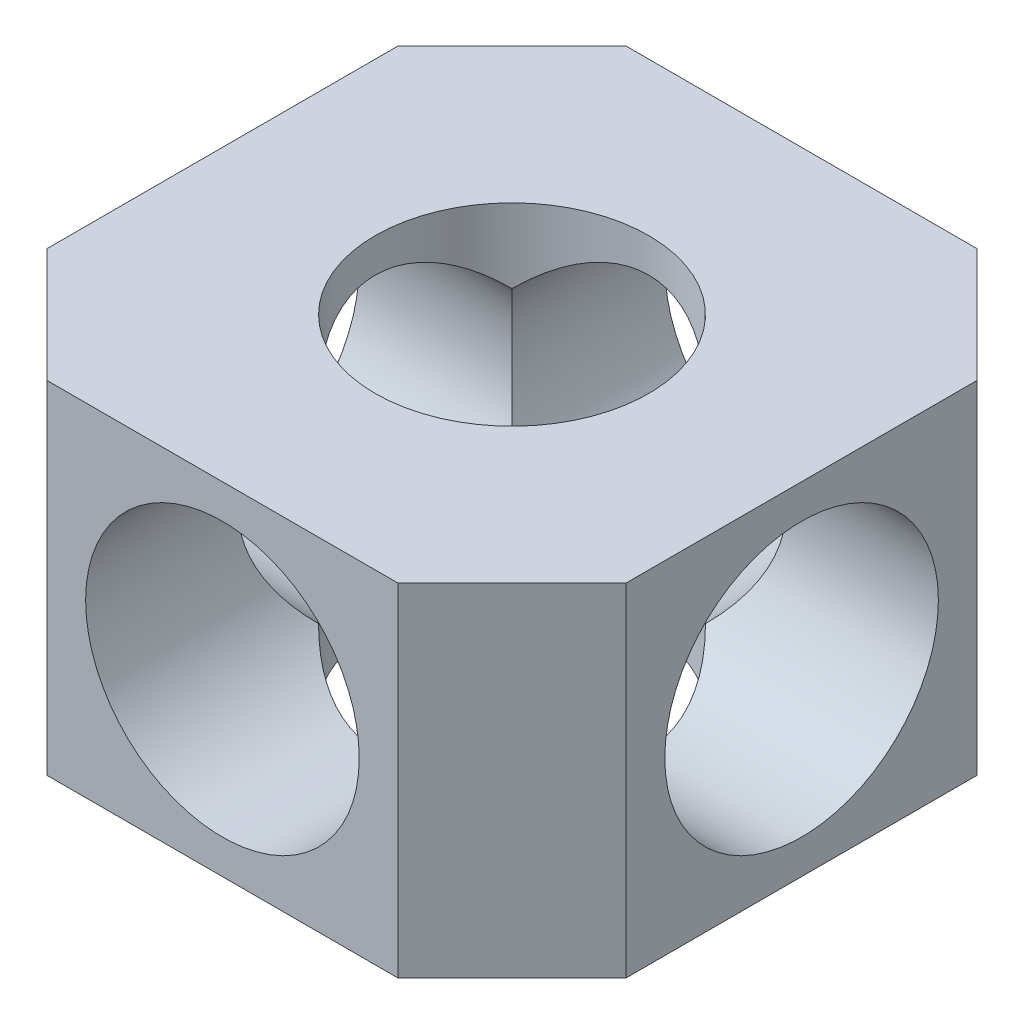
ISO-10303-21;
HEADER;
FILE_DESCRIPTION(('STEP AP214'),'2;1');
FILE_NAME('part.step','',(''),(''),'','','');
FILE_SCHEMA(('AUTOMOTIVE_DESIGN { 1 0 10303 214 1 1 1 1 }'));
ENDSEC;
DATA;
#1=APPLICATION_CONTEXT('core data for automotive mechanical design processes');
#2=APPLICATION_PROTOCOL_DEFINITION('international standard','automotive_design',2000,#1);
#3=PRODUCT_CONTEXT('',#1,'mechanical');
#4=PRODUCT('Part','Part','',(#3));
#5=PRODUCT_RELATED_PRODUCT_CATEGORY('part','',(#4));
#6=PRODUCT_DEFINITION_FORMATION('','',#4);
#7=PRODUCT_DEFINITION_CONTEXT('part definition',#1,'design');
#8=PRODUCT_DEFINITION('design','',#6,#7);
#9=PRODUCT_DEFINITION_SHAPE('','',#8);
#10=(LENGTH_UNIT() NAMED_UNIT(*) SI_UNIT(.MILLI.,.METRE.));
#11=(NAMED_UNIT(*) PLANE_ANGLE_UNIT() SI_UNIT($,.RADIAN.));
#12=(NAMED_UNIT(*) SI_UNIT($,.STERADIAN.) SOLID_ANGLE_UNIT());
#13=UNCERTAINTY_MEASURE_WITH_UNIT(LENGTH_MEASURE(1.E-05),#10,'distance_accuracy_value','');
#14=(GEOMETRIC_REPRESENTATION_CONTEXT(3) GLOBAL_UNCERTAINTY_ASSIGNED_CONTEXT((#13)) GLOBAL_UNIT_ASSIGNED_CONTEXT((#10,
#11,#12)) REPRESENTATION_CONTEXT('',''));
#15=CARTESIAN_POINT('',(0.,0.,0.));
#16=DIRECTION('',(0.,0.,1.));
#17=DIRECTION('',(1.,0.,0.));
#18=AXIS2_PLACEMENT_3D('',#15,#16,#17);
#19=CARTESIAN_POINT('',(0.,7.5,0.));
#20=DIRECTION('',(0.,-1.,0.));
#21=DIRECTION('',(0.,0.,-1.));
#22=AXIS2_PLACEMENT_3D('',#19,#20,#21);
#23=CYLINDRICAL_SURFACE('',#22,6.);
#24=CARTESIAN_POINT('',(0.,0.,0.));
#25=DIRECTION('',(0.707106781186547,-0.707106781186548,0.));
#26=DIRECTION('',(-0.707106781186547,-0.707106781186548,0.));
#27=AXIS2_PLACEMENT_3D('',#24,#25,#26);
#28=ELLIPSE('',#27,8.48528137423857,6.);
#29=CARTESIAN_POINT('',(4.24264068711928,4.24264068711928,4.24264068711929));
#30=VERTEX_POINT('',#29);
#31=CARTESIAN_POINT('',(4.24264068711928,4.24264068711929,-4.24264068711928));
#32=VERTEX_POINT('',#31);
#33=EDGE_CURVE('E131',#30,#32,#28,.F.);
#34=ORIENTED_EDGE('',*,*,#33,.F.);
#35=CARTESIAN_POINT('',(0.,0.,0.));
#36=DIRECTION('',(0.,-0.707106781186547,0.707106781186547));
#37=DIRECTION('',(0.,-0.707106781186547,-0.707106781186547));
#38=AXIS2_PLACEMENT_3D('',#35,#36,#37);
#39=ELLIPSE('',#38,8.48528137423857,6.);
#40=CARTESIAN_POINT('',(-4.24264068711929,4.24264068711929,4.24264068711929));
#41=VERTEX_POINT('',#40);
#42=EDGE_CURVE('E138',#41,#30,#39,.F.);
#43=ORIENTED_EDGE('',*,*,#42,.F.);
#44=CARTESIAN_POINT('',(0.,0.,0.));
#45=DIRECTION('',(-0.707106781186547,-0.707106781186548,0.));
#46=DIRECTION('',(0.707106781186547,-0.707106781186548,0.));
#47=AXIS2_PLACEMENT_3D('',#44,#45,#46);
#48=ELLIPSE('',#47,8.48528137423857,6.);
#49=CARTESIAN_POINT('',(-4.24264068711929,4.24264068711928,-4.24264068711928));
#50=VERTEX_POINT('',#49);
#51=EDGE_CURVE('E67',#50,#41,#48,.F.);
#52=ORIENTED_EDGE('',*,*,#51,.F.);
#53=CARTESIAN_POINT('',(0.,0.,0.));
#54=DIRECTION('',(0.,-0.707106781186547,-0.707106781186547));
#55=DIRECTION('',(0.,-0.707106781186547,0.707106781186547));
#56=AXIS2_PLACEMENT_3D('',#53,#54,#55);
#57=ELLIPSE('',#56,8.48528137423857,6.);
#58=EDGE_CURVE('E144',#32,#50,#57,.F.);
#59=ORIENTED_EDGE('',*,*,#58,.F.);
#60=EDGE_LOOP('',(#34,#43,#52,#59));
#61=FACE_BOUND('',#60,.T.);
#62=CARTESIAN_POINT('',(0.,7.5,0.));
#63=DIRECTION('',(0.,1.,0.));
#64=DIRECTION('',(0.,0.,1.));
#65=AXIS2_PLACEMENT_3D('',#62,#63,#64);
#66=CIRCLE('',#65,6.);
#67=CARTESIAN_POINT('',(0.,7.5,6.));
#68=VERTEX_POINT('',#67);
#69=EDGE_CURVE('E221',#68,#68,#66,.T.);
#70=ORIENTED_EDGE('',*,*,#69,.T.);
#71=EDGE_LOOP('',(#70));
#72=FACE_BOUND('',#71,.T.);
#73=ADVANCED_FACE('F43',(#61,#72),#23,.F.);
#74=CARTESIAN_POINT('',(0.,7.5,0.));
#75=DIRECTION('',(0.,1.,0.));
#76=DIRECTION('',(0.,0.,1.));
#77=AXIS2_PLACEMENT_3D('',#74,#75,#76);
#78=PLANE('',#77);
#79=DIRECTION('',(0.,0.,1.));
#80=VECTOR('',#79,1.);
#81=CARTESIAN_POINT('',(-12.7,7.5,-7.7));
#82=LINE('',#81,#80);
#83=CARTESIAN_POINT('',(-12.7,7.5,-7.7));
#84=VERTEX_POINT('',#83);
#85=CARTESIAN_POINT('',(-12.7,7.5,7.7));
#86=VERTEX_POINT('',#85);
#87=EDGE_CURVE('E198',#84,#86,#82,.T.);
#88=ORIENTED_EDGE('',*,*,#87,.T.);
#89=DIRECTION('',(0.707106781186548,0.,0.707106781186547));
#90=VECTOR('',#89,1.);
#91=CARTESIAN_POINT('',(-12.7,7.5,7.7));
#92=LINE('',#91,#90);
#93=CARTESIAN_POINT('',(-7.69999999999999,7.5,12.7));
#94=VERTEX_POINT('',#93);
#95=EDGE_CURVE('E239',#86,#94,#92,.T.);
#96=ORIENTED_EDGE('',*,*,#95,.T.);
#97=DIRECTION('',(1.,0.,0.));
#98=VECTOR('',#97,1.);
#99=CARTESIAN_POINT('',(-7.69999999999999,7.5,12.7));
#100=LINE('',#99,#98);
#101=CARTESIAN_POINT('',(7.7,7.5,12.7));
#102=VERTEX_POINT('',#101);
#103=EDGE_CURVE('E236',#94,#102,#100,.T.);
#104=ORIENTED_EDGE('',*,*,#103,.T.);
#105=DIRECTION('',(0.707106781186548,0.,-0.707106781186548));
#106=VECTOR('',#105,1.);
#107=CARTESIAN_POINT('',(7.7,7.5,12.7));
#108=LINE('',#107,#106);
#109=CARTESIAN_POINT('',(12.7,7.5,7.7));
#110=VERTEX_POINT('',#109);
#111=EDGE_CURVE('E233',#102,#110,#108,.T.);
#112=ORIENTED_EDGE('',*,*,#111,.T.);
#113=DIRECTION('',(0.,0.,-1.));
#114=VECTOR('',#113,1.);
#115=CARTESIAN_POINT('',(12.7,7.5,-7.7));
#116=LINE('',#115,#114);
#117=CARTESIAN_POINT('',(12.7,7.5,-7.7));
#118=VERTEX_POINT('',#117);
#119=EDGE_CURVE('E230',#110,#118,#116,.T.);
#120=ORIENTED_EDGE('',*,*,#119,.T.);
#121=DIRECTION('',(-0.707106781186548,0.,-0.707106781186548));
#122=VECTOR('',#121,1.);
#123=CARTESIAN_POINT('',(7.7,7.5,-12.7));
#124=LINE('',#123,#122);
#125=CARTESIAN_POINT('',(7.7,7.5,-12.7));
#126=VERTEX_POINT('',#125);
#127=EDGE_CURVE('E227',#118,#126,#124,.T.);
#128=ORIENTED_EDGE('',*,*,#127,.T.);
#129=DIRECTION('',(-1.,0.,0.));
#130=VECTOR('',#129,1.);
#131=CARTESIAN_POINT('',(-7.7,7.5,-12.7));
#132=LINE('',#131,#130);
#133=CARTESIAN_POINT('',(-7.7,7.5,-12.7));
#134=VERTEX_POINT('',#133);
#135=EDGE_CURVE('E224',#126,#134,#132,.T.);
#136=ORIENTED_EDGE('',*,*,#135,.T.);
#137=DIRECTION('',(-0.707106781186548,0.,0.707106781186548));
#138=VECTOR('',#137,1.);
#139=CARTESIAN_POINT('',(-12.7,7.5,-7.7));
#140=LINE('',#139,#138);
#141=EDGE_CURVE('E194',#134,#84,#140,.T.);
#142=ORIENTED_EDGE('',*,*,#141,.T.);
#143=EDGE_LOOP('',(#88,#96,#104,#112,#120,#128,#136,#142));
#144=FACE_BOUND('',#143,.T.);
#145=ORIENTED_EDGE('',*,*,#69,.F.);
#146=EDGE_LOOP('',(#145));
#147=FACE_BOUND('',#146,.T.);
#148=ADVANCED_FACE('F293',(#144,#147),#78,.T.);
#149=CARTESIAN_POINT('',(0.,-7.5,0.));
#150=DIRECTION('',(0.,1.,0.));
#151=DIRECTION('',(0.,0.,1.));
#152=AXIS2_PLACEMENT_3D('',#149,#150,#151);
#153=PLANE('',#152);
#154=DIRECTION('',(0.,0.,1.));
#155=VECTOR('',#154,1.);
#156=CARTESIAN_POINT('',(-12.7,-7.5,-7.7));
#157=LINE('',#156,#155);
#158=CARTESIAN_POINT('',(-12.7,-7.5,-7.7));
#159=VERTEX_POINT('',#158);
#160=CARTESIAN_POINT('',(-12.7,-7.5,7.7));
#161=VERTEX_POINT('',#160);
#162=EDGE_CURVE('E217',#159,#161,#157,.T.);
#163=ORIENTED_EDGE('',*,*,#162,.F.);
#164=DIRECTION('',(-0.707106781186548,0.,0.707106781186548));
#165=VECTOR('',#164,1.);
#166=CARTESIAN_POINT('',(-12.7,-7.5,-7.7));
#167=LINE('',#166,#165);
#168=CARTESIAN_POINT('',(-7.7,-7.5,-12.7));
#169=VERTEX_POINT('',#168);
#170=EDGE_CURVE('E195',#169,#159,#167,.T.);
#171=ORIENTED_EDGE('',*,*,#170,.F.);
#172=DIRECTION('',(-1.,0.,0.));
#173=VECTOR('',#172,1.);
#174=CARTESIAN_POINT('',(-7.7,-7.5,-12.7));
#175=LINE('',#174,#173);
#176=CARTESIAN_POINT('',(7.7,-7.5,-12.7));
#177=VERTEX_POINT('',#176);
#178=EDGE_CURVE('E199',#177,#169,#175,.T.);
#179=ORIENTED_EDGE('',*,*,#178,.F.);
#180=DIRECTION('',(-0.707106781186548,0.,-0.707106781186548));
#181=VECTOR('',#180,1.);
#182=CARTESIAN_POINT('',(7.7,-7.5,-12.7));
#183=LINE('',#182,#181);
#184=CARTESIAN_POINT('',(12.7,-7.5,-7.7));
#185=VERTEX_POINT('',#184);
#186=EDGE_CURVE('E202',#185,#177,#183,.T.);
#187=ORIENTED_EDGE('',*,*,#186,.F.);
#188=DIRECTION('',(0.,0.,-1.));
#189=VECTOR('',#188,1.);
#190=CARTESIAN_POINT('',(12.7,-7.5,-7.7));
#191=LINE('',#190,#189);
#192=CARTESIAN_POINT('',(12.7,-7.5,7.7));
#193=VERTEX_POINT('',#192);
#194=EDGE_CURVE('E205',#193,#185,#191,.T.);
#195=ORIENTED_EDGE('',*,*,#194,.F.);
#196=DIRECTION('',(0.707106781186548,0.,-0.707106781186548));
#197=VECTOR('',#196,1.);
#198=CARTESIAN_POINT('',(7.7,-7.5,12.7));
#199=LINE('',#198,#197);
#200=CARTESIAN_POINT('',(7.7,-7.5,12.7));
#201=VERTEX_POINT('',#200);
#202=EDGE_CURVE('E208',#201,#193,#199,.T.);
#203=ORIENTED_EDGE('',*,*,#202,.F.);
#204=DIRECTION('',(1.,0.,0.));
#205=VECTOR('',#204,1.);
#206=CARTESIAN_POINT('',(-7.69999999999999,-7.5,12.7));
#207=LINE('',#206,#205);
#208=CARTESIAN_POINT('',(-7.69999999999999,-7.5,12.7));
#209=VERTEX_POINT('',#208);
#210=EDGE_CURVE('E211',#209,#201,#207,.T.);
#211=ORIENTED_EDGE('',*,*,#210,.F.);
#212=DIRECTION('',(0.707106781186548,0.,0.707106781186547));
#213=VECTOR('',#212,1.);
#214=CARTESIAN_POINT('',(-12.7,-7.5,7.7));
#215=LINE('',#214,#213);
#216=EDGE_CURVE('E214',#161,#209,#215,.T.);
#217=ORIENTED_EDGE('',*,*,#216,.F.);
#218=EDGE_LOOP('',(#163,#171,#179,#187,#195,#203,#211,#217));
#219=FACE_BOUND('',#218,.T.);
#220=CARTESIAN_POINT('',(0.,-7.5,0.));
#221=DIRECTION('',(0.,1.,0.));
#222=DIRECTION('',(0.,0.,1.));
#223=AXIS2_PLACEMENT_3D('',#220,#221,#222);
#224=CIRCLE('',#223,6.);
#225=CARTESIAN_POINT('',(0.,-7.5,6.));
#226=VERTEX_POINT('',#225);
#227=EDGE_CURVE('E245',#226,#226,#224,.T.);
#228=ORIENTED_EDGE('',*,*,#227,.T.);
#229=EDGE_LOOP('',(#228));
#230=FACE_BOUND('',#229,.T.);
#231=ADVANCED_FACE('F299',(#219,#230),#153,.F.);
#232=CARTESIAN_POINT('',(-12.7,7.5,-7.7));
#233=DIRECTION('',(1.,0.,0.));
#234=DIRECTION('',(0.,0.,-1.));
#235=AXIS2_PLACEMENT_3D('',#232,#233,#234);
#236=PLANE('',#235);
#237=CARTESIAN_POINT('',(-12.7,0.,0.));
#238=DIRECTION('',(1.,0.,0.));
#239=DIRECTION('',(0.,0.,-1.));
#240=AXIS2_PLACEMENT_3D('',#237,#238,#239);
#241=CIRCLE('',#240,6.);
#242=CARTESIAN_POINT('',(-12.7,0.,-6.));
#243=VERTEX_POINT('',#242);
#244=EDGE_CURVE('E273',#243,#243,#241,.T.);
#245=ORIENTED_EDGE('',*,*,#244,.T.);
#246=EDGE_LOOP('',(#245));
#247=FACE_BOUND('',#246,.T.);
#248=ORIENTED_EDGE('',*,*,#162,.T.);
#249=DIRECTION('',(0.,-1.,0.));
#250=VECTOR('',#249,1.);
#251=CARTESIAN_POINT('',(-12.7,7.5,7.7));
#252=LINE('',#251,#250);
#253=EDGE_CURVE('E162',#86,#161,#252,.T.);
#254=ORIENTED_EDGE('',*,*,#253,.F.);
#255=ORIENTED_EDGE('',*,*,#87,.F.);
#256=DIRECTION('',(0.,-1.,0.));
#257=VECTOR('',#256,1.);
#258=CARTESIAN_POINT('',(-12.7,7.5,-7.7));
#259=LINE('',#258,#257);
#260=EDGE_CURVE('E190',#84,#159,#259,.T.);
#261=ORIENTED_EDGE('',*,*,#260,.T.);
#262=EDGE_LOOP('',(#248,#254,#255,#261));
#263=FACE_BOUND('',#262,.T.);
#264=ADVANCED_FACE('F45',(#247,#263),#236,.F.);
#265=CARTESIAN_POINT('',(-12.7,7.5,7.7));
#266=DIRECTION('',(0.707106781186547,0.,-0.707106781186548));
#267=DIRECTION('',(-0.707106781186548,0.,-0.707106781186547));
#268=AXIS2_PLACEMENT_3D('',#265,#266,#267);
#269=PLANE('',#268);
#270=ORIENTED_EDGE('',*,*,#216,.T.);
#271=DIRECTION('',(0.,-1.,0.));
#272=VECTOR('',#271,1.);
#273=CARTESIAN_POINT('',(-7.69999999999999,7.5,12.7));
#274=LINE('',#273,#272);
#275=EDGE_CURVE('E166',#94,#209,#274,.T.);
#276=ORIENTED_EDGE('',*,*,#275,.F.);
#277=ORIENTED_EDGE('',*,*,#95,.F.);
#278=ORIENTED_EDGE('',*,*,#253,.T.);
#279=EDGE_LOOP('',(#270,#276,#277,#278));
#280=FACE_BOUND('',#279,.T.);
#281=ADVANCED_FACE('F325',(#280),#269,.F.);
#282=CARTESIAN_POINT('',(-7.69999999999999,7.5,12.7));
#283=DIRECTION('',(0.,0.,-1.));
#284=DIRECTION('',(-1.,0.,0.));
#285=AXIS2_PLACEMENT_3D('',#282,#283,#284);
#286=PLANE('',#285);
#287=CARTESIAN_POINT('',(0.,0.,12.7));
#288=DIRECTION('',(0.,0.,1.));
#289=DIRECTION('',(1.,0.,0.));
#290=AXIS2_PLACEMENT_3D('',#287,#288,#289);
#291=CIRCLE('',#290,6.);
#292=CARTESIAN_POINT('',(6.,0.,12.7));
#293=VERTEX_POINT('',#292);
#294=EDGE_CURVE('E253',#293,#293,#291,.T.);
#295=ORIENTED_EDGE('',*,*,#294,.F.);
#296=EDGE_LOOP('',(#295));
#297=FACE_BOUND('',#296,.T.);
#298=ORIENTED_EDGE('',*,*,#210,.T.);
#299=DIRECTION('',(0.,-1.,0.));
#300=VECTOR('',#299,1.);
#301=CARTESIAN_POINT('',(7.7,7.5,12.7));
#302=LINE('',#301,#300);
#303=EDGE_CURVE('E170',#102,#201,#302,.T.);
#304=ORIENTED_EDGE('',*,*,#303,.F.);
#305=ORIENTED_EDGE('',*,*,#103,.F.);
#306=ORIENTED_EDGE('',*,*,#275,.T.);
#307=EDGE_LOOP('',(#298,#304,#305,#306));
#308=FACE_BOUND('',#307,.T.);
#309=ADVANCED_FACE('F342',(#297,#308),#286,.F.);
#310=CARTESIAN_POINT('',(7.7,7.5,12.7));
#311=DIRECTION('',(-0.707106781186547,0.,-0.707106781186547));
#312=DIRECTION('',(-0.707106781186548,0.,0.707106781186548));
#313=AXIS2_PLACEMENT_3D('',#310,#311,#312);
#314=PLANE('',#313);
#315=ORIENTED_EDGE('',*,*,#202,.T.);
#316=DIRECTION('',(0.,-1.,0.));
#317=VECTOR('',#316,1.);
#318=CARTESIAN_POINT('',(12.7,7.5,7.7));
#319=LINE('',#318,#317);
#320=EDGE_CURVE('E174',#110,#193,#319,.T.);
#321=ORIENTED_EDGE('',*,*,#320,.F.);
#322=ORIENTED_EDGE('',*,*,#111,.F.);
#323=ORIENTED_EDGE('',*,*,#303,.T.);
#324=EDGE_LOOP('',(#315,#321,#322,#323));
#325=FACE_BOUND('',#324,.T.);
#326=ADVANCED_FACE('F338',(#325),#314,.F.);
#327=CARTESIAN_POINT('',(12.7,7.5,-7.7));
#328=DIRECTION('',(-1.,0.,0.));
#329=DIRECTION('',(0.,0.,1.));
#330=AXIS2_PLACEMENT_3D('',#327,#328,#329);
#331=PLANE('',#330);
#332=CARTESIAN_POINT('',(12.7,0.,0.));
#333=DIRECTION('',(1.,0.,0.));
#334=DIRECTION('',(0.,0.,-1.));
#335=AXIS2_PLACEMENT_3D('',#332,#333,#334);
#336=CIRCLE('',#335,6.);
#337=CARTESIAN_POINT('',(12.7,0.,-6.));
#338=VERTEX_POINT('',#337);
#339=EDGE_CURVE('E274',#338,#338,#336,.T.);
#340=ORIENTED_EDGE('',*,*,#339,.F.);
#341=EDGE_LOOP('',(#340));
#342=FACE_BOUND('',#341,.T.);
#343=ORIENTED_EDGE('',*,*,#194,.T.);
#344=DIRECTION('',(0.,-1.,0.));
#345=VECTOR('',#344,1.);
#346=CARTESIAN_POINT('',(12.7,7.5,-7.7));
#347=LINE('',#346,#345);
#348=EDGE_CURVE('E178',#118,#185,#347,.T.);
#349=ORIENTED_EDGE('',*,*,#348,.F.);
#350=ORIENTED_EDGE('',*,*,#119,.F.);
#351=ORIENTED_EDGE('',*,*,#320,.T.);
#352=EDGE_LOOP('',(#343,#349,#350,#351));
#353=FACE_BOUND('',#352,.T.);
#354=ADVANCED_FACE('F334',(#342,#353),#331,.F.);
#355=CARTESIAN_POINT('',(7.7,7.5,-12.7));
#356=DIRECTION('',(-0.707106781186547,0.,0.707106781186547));
#357=DIRECTION('',(0.707106781186548,0.,0.707106781186548));
#358=AXIS2_PLACEMENT_3D('',#355,#356,#357);
#359=PLANE('',#358);
#360=ORIENTED_EDGE('',*,*,#186,.T.);
#361=DIRECTION('',(0.,-1.,0.));
#362=VECTOR('',#361,1.);
#363=CARTESIAN_POINT('',(7.7,7.5,-12.7));
#364=LINE('',#363,#362);
#365=EDGE_CURVE('E182',#126,#177,#364,.T.);
#366=ORIENTED_EDGE('',*,*,#365,.F.);
#367=ORIENTED_EDGE('',*,*,#127,.F.);
#368=ORIENTED_EDGE('',*,*,#348,.T.);
#369=EDGE_LOOP('',(#360,#366,#367,#368));
#370=FACE_BOUND('',#369,.T.);
#371=ADVANCED_FACE('F330',(#370),#359,.F.);
#372=CARTESIAN_POINT('',(-7.7,7.5,-12.7));
#373=DIRECTION('',(0.,0.,1.));
#374=DIRECTION('',(1.,0.,0.));
#375=AXIS2_PLACEMENT_3D('',#372,#373,#374);
#376=PLANE('',#375);
#377=CARTESIAN_POINT('',(0.,0.,-12.7));
#378=DIRECTION('',(0.,0.,1.));
#379=DIRECTION('',(1.,0.,0.));
#380=AXIS2_PLACEMENT_3D('',#377,#378,#379);
#381=CIRCLE('',#380,6.);
#382=CARTESIAN_POINT('',(6.,0.,-12.7));
#383=VERTEX_POINT('',#382);
#384=EDGE_CURVE('E249',#383,#383,#381,.T.);
#385=ORIENTED_EDGE('',*,*,#384,.T.);
#386=EDGE_LOOP('',(#385));
#387=FACE_BOUND('',#386,.T.);
#388=ORIENTED_EDGE('',*,*,#178,.T.);
#389=DIRECTION('',(0.,-1.,0.));
#390=VECTOR('',#389,1.);
#391=CARTESIAN_POINT('',(-7.7,7.5,-12.7));
#392=LINE('',#391,#390);
#393=EDGE_CURVE('E186',#134,#169,#392,.T.);
#394=ORIENTED_EDGE('',*,*,#393,.F.);
#395=ORIENTED_EDGE('',*,*,#135,.F.);
#396=ORIENTED_EDGE('',*,*,#365,.T.);
#397=EDGE_LOOP('',(#388,#394,#395,#396));
#398=FACE_BOUND('',#397,.T.);
#399=ADVANCED_FACE('F311',(#387,#398),#376,.F.);
#400=CARTESIAN_POINT('',(-12.7,7.5,-7.7));
#401=DIRECTION('',(0.707106781186547,0.,0.707106781186547));
#402=DIRECTION('',(0.707106781186548,0.,-0.707106781186548));
#403=AXIS2_PLACEMENT_3D('',#400,#401,#402);
#404=PLANE('',#403);
#405=ORIENTED_EDGE('',*,*,#170,.T.);
#406=ORIENTED_EDGE('',*,*,#260,.F.);
#407=ORIENTED_EDGE('',*,*,#141,.F.);
#408=ORIENTED_EDGE('',*,*,#393,.T.);
#409=EDGE_LOOP('',(#405,#406,#407,#408));
#410=FACE_BOUND('',#409,.T.);
#411=ADVANCED_FACE('F304',(#410),#404,.F.);
#412=CARTESIAN_POINT('',(0.,0.,0.));
#413=DIRECTION('',(0.707106781186547,-0.707106781186548,0.));
#414=DIRECTION('',(-0.707106781186547,-0.707106781186548,0.));
#415=AXIS2_PLACEMENT_3D('',#412,#413,#414);
#416=ELLIPSE('',#415,8.48528137423857,6.);
#417=CARTESIAN_POINT('',(-4.24264068711929,-4.24264068711929,4.24264068711929));
#418=VERTEX_POINT('',#417);
#419=CARTESIAN_POINT('',(-4.24264068711929,-4.24264068711928,-4.24264068711928));
#420=VERTEX_POINT('',#419);
#421=EDGE_CURVE('E266',#418,#420,#416,.T.);
#422=ORIENTED_EDGE('',*,*,#421,.F.);
#423=CARTESIAN_POINT('',(0.,0.,0.));
#424=DIRECTION('',(0.,-0.707106781186547,-0.707106781186547));
#425=DIRECTION('',(0.,-0.707106781186547,0.707106781186547));
#426=AXIS2_PLACEMENT_3D('',#423,#424,#425);
#427=ELLIPSE('',#426,8.48528137423857,6.);
#428=CARTESIAN_POINT('',(4.24264068711928,-4.24264068711928,4.24264068711929));
#429=VERTEX_POINT('',#428);
#430=EDGE_CURVE('E155',#429,#418,#427,.T.);
#431=ORIENTED_EDGE('',*,*,#430,.F.);
#432=CARTESIAN_POINT('',(0.,0.,0.));
#433=DIRECTION('',(-0.707106781186547,-0.707106781186548,0.));
#434=DIRECTION('',(0.707106781186547,-0.707106781186548,0.));
#435=AXIS2_PLACEMENT_3D('',#432,#433,#434);
#436=ELLIPSE('',#435,8.48528137423857,6.);
#437=CARTESIAN_POINT('',(4.24264068711928,-4.24264068711929,-4.24264068711929));
#438=VERTEX_POINT('',#437);
#439=EDGE_CURVE('E59',#438,#429,#436,.T.);
#440=ORIENTED_EDGE('',*,*,#439,.F.);
#441=CARTESIAN_POINT('',(0.,0.,0.));
#442=DIRECTION('',(0.,-0.707106781186547,0.707106781186547));
#443=DIRECTION('',(0.,-0.707106781186547,-0.707106781186547));
#444=AXIS2_PLACEMENT_3D('',#441,#442,#443);
#445=ELLIPSE('',#444,8.48528137423857,6.);
#446=EDGE_CURVE('E151',#420,#438,#445,.T.);
#447=ORIENTED_EDGE('',*,*,#446,.F.);
#448=EDGE_LOOP('',(#422,#431,#440,#447));
#449=FACE_BOUND('',#448,.T.);
#450=ORIENTED_EDGE('',*,*,#227,.F.);
#451=EDGE_LOOP('',(#450));
#452=FACE_BOUND('',#451,.T.);
#453=ADVANCED_FACE('F295',(#449,#452),#23,.F.);
#454=CARTESIAN_POINT('',(0.,0.,-12.7));
#455=DIRECTION('',(0.,0.,1.));
#456=DIRECTION('',(1.,0.,0.));
#457=AXIS2_PLACEMENT_3D('',#454,#455,#456);
#458=CYLINDRICAL_SURFACE('',#457,6.);
#459=ORIENTED_EDGE('',*,*,#446,.T.);
#460=CARTESIAN_POINT('',(0.,0.,0.));
#461=DIRECTION('',(0.707106781186547,0.,0.707106781186547));
#462=DIRECTION('',(-0.707106781186547,0.,0.707106781186548));
#463=AXIS2_PLACEMENT_3D('',#460,#461,#462);
#464=ELLIPSE('',#463,8.48528137423857,6.);
#465=EDGE_CURVE('E146',#438,#32,#464,.T.);
#466=ORIENTED_EDGE('',*,*,#465,.T.);
#467=ORIENTED_EDGE('',*,*,#58,.T.);
#468=CARTESIAN_POINT('',(0.,0.,0.));
#469=DIRECTION('',(-0.707106781186547,0.,0.707106781186548));
#470=DIRECTION('',(0.707106781186547,0.,0.707106781186547));
#471=AXIS2_PLACEMENT_3D('',#468,#469,#470);
#472=ELLIPSE('',#471,8.48528137423857,6.);
#473=EDGE_CURVE('E257',#50,#420,#472,.T.);
#474=ORIENTED_EDGE('',*,*,#473,.T.);
#475=EDGE_LOOP('',(#459,#466,#467,#474));
#476=FACE_BOUND('',#475,.T.);
#477=ORIENTED_EDGE('',*,*,#384,.F.);
#478=EDGE_LOOP('',(#477));
#479=FACE_BOUND('',#478,.T.);
#480=ADVANCED_FACE('F303',(#476,#479),#458,.F.);
#481=ORIENTED_EDGE('',*,*,#430,.T.);
#482=CARTESIAN_POINT('',(0.,0.,0.));
#483=DIRECTION('',(0.707106781186547,0.,0.707106781186547));
#484=DIRECTION('',(-0.707106781186547,0.,0.707106781186548));
#485=AXIS2_PLACEMENT_3D('',#482,#483,#484);
#486=ELLIPSE('',#485,8.48528137423857,6.);
#487=EDGE_CURVE('E11',#418,#41,#486,.F.);
#488=ORIENTED_EDGE('',*,*,#487,.T.);
#489=ORIENTED_EDGE('',*,*,#42,.T.);
#490=CARTESIAN_POINT('',(0.,0.,0.));
#491=DIRECTION('',(-0.707106781186547,0.,0.707106781186548));
#492=DIRECTION('',(0.707106781186547,0.,0.707106781186547));
#493=AXIS2_PLACEMENT_3D('',#490,#491,#492);
#494=ELLIPSE('',#493,8.48528137423857,6.);
#495=EDGE_CURVE('E52',#30,#429,#494,.F.);
#496=ORIENTED_EDGE('',*,*,#495,.T.);
#497=EDGE_LOOP('',(#481,#488,#489,#496));
#498=FACE_BOUND('',#497,.T.);
#499=ORIENTED_EDGE('',*,*,#294,.T.);
#500=EDGE_LOOP('',(#499));
#501=FACE_BOUND('',#500,.T.);
#502=ADVANCED_FACE('F148',(#498,#501),#458,.F.);
#503=CARTESIAN_POINT('',(-12.7,0.,0.));
#504=DIRECTION('',(1.,0.,0.));
#505=DIRECTION('',(0.,0.,-1.));
#506=AXIS2_PLACEMENT_3D('',#503,#504,#505);
#507=CYLINDRICAL_SURFACE('',#506,6.);
#508=ORIENTED_EDGE('',*,*,#339,.T.);
#509=EDGE_LOOP('',(#508));
#510=FACE_BOUND('',#509,.T.);
#511=ORIENTED_EDGE('',*,*,#439,.T.);
#512=ORIENTED_EDGE('',*,*,#495,.F.);
#513=ORIENTED_EDGE('',*,*,#33,.T.);
#514=ORIENTED_EDGE('',*,*,#465,.F.);
#515=EDGE_LOOP('',(#511,#512,#513,#514));
#516=FACE_BOUND('',#515,.T.);
#517=ADVANCED_FACE('F130',(#510,#516),#507,.F.);
#518=ORIENTED_EDGE('',*,*,#244,.F.);
#519=EDGE_LOOP('',(#518));
#520=FACE_BOUND('',#519,.T.);
#521=ORIENTED_EDGE('',*,*,#51,.T.);
#522=ORIENTED_EDGE('',*,*,#487,.F.);
#523=ORIENTED_EDGE('',*,*,#421,.T.);
#524=ORIENTED_EDGE('',*,*,#473,.F.);
#525=EDGE_LOOP('',(#521,#522,#523,#524));
#526=FACE_BOUND('',#525,.T.);
#527=ADVANCED_FACE('F284',(#520,#526),#507,.F.);
#528=CLOSED_SHELL('',(#73,#148,#231,#264,#281,#309,#326,#354,#371,#399,#411,#453,#480,#502,#517,#527));
#529=MANIFOLD_SOLID_BREP('B2',#528);
#530=ADVANCED_BREP_SHAPE_REPRESENTATION('',(#18,#529),#14);
#531=SHAPE_DEFINITION_REPRESENTATION(#9,#530);
ENDSEC;
END-ISO-10303-21;
